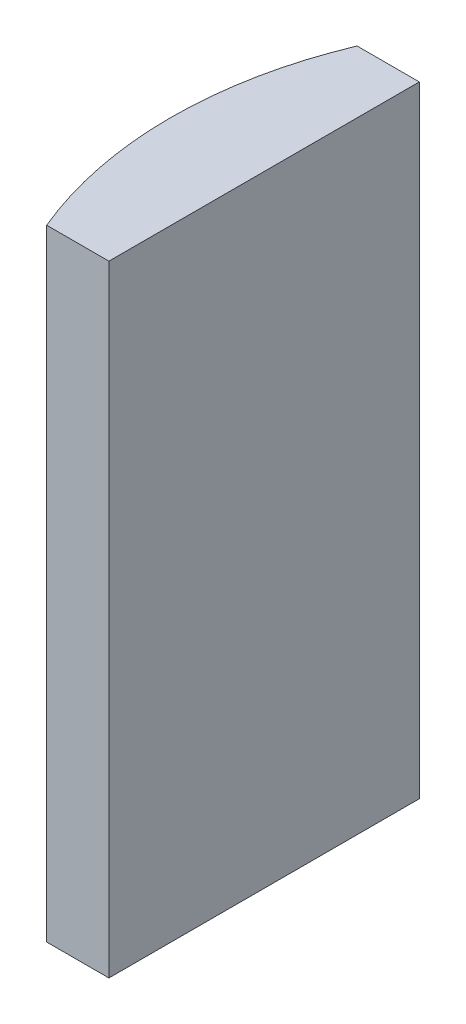
ISO-10303-21;
HEADER;
FILE_DESCRIPTION(('STEP AP214'),'2;1');
FILE_NAME('part.step','',(''),(''),'','','');
FILE_SCHEMA(('AUTOMOTIVE_DESIGN { 1 0 10303 214 1 1 1 1 }'));
ENDSEC;
DATA;
#1=APPLICATION_CONTEXT('core data for automotive mechanical design processes');
#2=APPLICATION_PROTOCOL_DEFINITION('international standard','automotive_design',2000,#1);
#3=PRODUCT_CONTEXT('',#1,'mechanical');
#4=PRODUCT('Part','Part','',(#3));
#5=PRODUCT_RELATED_PRODUCT_CATEGORY('part','',(#4));
#6=PRODUCT_DEFINITION_FORMATION('','',#4);
#7=PRODUCT_DEFINITION_CONTEXT('part definition',#1,'design');
#8=PRODUCT_DEFINITION('design','',#6,#7);
#9=PRODUCT_DEFINITION_SHAPE('','',#8);
#10=(LENGTH_UNIT() NAMED_UNIT(*) SI_UNIT(.MILLI.,.METRE.));
#11=(NAMED_UNIT(*) PLANE_ANGLE_UNIT() SI_UNIT($,.RADIAN.));
#12=(NAMED_UNIT(*) SI_UNIT($,.STERADIAN.) SOLID_ANGLE_UNIT());
#13=UNCERTAINTY_MEASURE_WITH_UNIT(LENGTH_MEASURE(1.E-05),#10,'distance_accuracy_value','');
#14=(GEOMETRIC_REPRESENTATION_CONTEXT(3) GLOBAL_UNCERTAINTY_ASSIGNED_CONTEXT((#13)) GLOBAL_UNIT_ASSIGNED_CONTEXT((#10,
#11,#12)) REPRESENTATION_CONTEXT('',''));
#15=CARTESIAN_POINT('',(0.,0.,0.));
#16=DIRECTION('',(0.,0.,1.));
#17=DIRECTION('',(1.,0.,0.));
#18=AXIS2_PLACEMENT_3D('',#15,#16,#17);
#19=CARTESIAN_POINT('',(4.35520433485127,20.,0.));
#20=DIRECTION('',(0.,-1.,0.));
#21=DIRECTION('',(0.,0.,-1.));
#22=AXIS2_PLACEMENT_3D('',#19,#20,#21);
#23=CYLINDRICAL_SURFACE('',#22,12.93);
#24=CARTESIAN_POINT('',(4.35520433485127,0.,0.));
#25=DIRECTION('',(0.,1.,0.));
#26=DIRECTION('',(0.,0.,1.));
#27=AXIS2_PLACEMENT_3D('',#24,#25,#26);
#28=CIRCLE('',#27,12.93);
#29=CARTESIAN_POINT('',(-7.56892666073915,0.,-5.));
#30=VERTEX_POINT('',#29);
#31=CARTESIAN_POINT('',(-7.56892666073915,0.,5.));
#32=VERTEX_POINT('',#31);
#33=EDGE_CURVE('E100',#30,#32,#28,.T.);
#34=ORIENTED_EDGE('',*,*,#33,.T.);
#35=DIRECTION('',(0.,-1.,0.));
#36=VECTOR('',#35,1.);
#37=CARTESIAN_POINT('',(-7.56892666073915,20.,5.));
#38=LINE('',#37,#36);
#39=CARTESIAN_POINT('',(-7.56892666073915,20.,5.));
#40=VERTEX_POINT('',#39);
#41=EDGE_CURVE('E11',#40,#32,#38,.T.);
#42=ORIENTED_EDGE('',*,*,#41,.F.);
#43=CARTESIAN_POINT('',(4.35520433485127,20.,0.));
#44=DIRECTION('',(0.,1.,0.));
#45=DIRECTION('',(0.,0.,1.));
#46=AXIS2_PLACEMENT_3D('',#43,#44,#45);
#47=CIRCLE('',#46,12.93);
#48=CARTESIAN_POINT('',(-7.56892666073915,20.,-5.));
#49=VERTEX_POINT('',#48);
#50=EDGE_CURVE('E88',#49,#40,#47,.T.);
#51=ORIENTED_EDGE('',*,*,#50,.F.);
#52=DIRECTION('',(0.,-1.,0.));
#53=VECTOR('',#52,1.);
#54=CARTESIAN_POINT('',(-7.56892666073915,20.,-5.));
#55=LINE('',#54,#53);
#56=EDGE_CURVE('E96',#49,#30,#55,.T.);
#57=ORIENTED_EDGE('',*,*,#56,.T.);
#58=EDGE_LOOP('',(#34,#42,#51,#57));
#59=FACE_BOUND('',#58,.T.);
#60=ADVANCED_FACE('F37',(#59),#23,.T.);
#61=CARTESIAN_POINT('',(-7.56892666073915,20.,5.));
#62=DIRECTION('',(0.,0.,-1.));
#63=DIRECTION('',(-1.,0.,0.));
#64=AXIS2_PLACEMENT_3D('',#61,#62,#63);
#65=PLANE('',#64);
#66=DIRECTION('',(1.,0.,0.));
#67=VECTOR('',#66,1.);
#68=CARTESIAN_POINT('',(-7.56892666073915,0.,5.));
#69=LINE('',#68,#67);
#70=CARTESIAN_POINT('',(-5.56479566514873,0.,5.));
#71=VERTEX_POINT('',#70);
#72=EDGE_CURVE('E92',#32,#71,#69,.T.);
#73=ORIENTED_EDGE('',*,*,#72,.T.);
#74=DIRECTION('',(0.,-1.,0.));
#75=VECTOR('',#74,1.);
#76=CARTESIAN_POINT('',(-5.56479566514873,20.,5.));
#77=LINE('',#76,#75);
#78=CARTESIAN_POINT('',(-5.56479566514873,20.,5.));
#79=VERTEX_POINT('',#78);
#80=EDGE_CURVE('E45',#79,#71,#77,.T.);
#81=ORIENTED_EDGE('',*,*,#80,.F.);
#82=DIRECTION('',(1.,0.,0.));
#83=VECTOR('',#82,1.);
#84=CARTESIAN_POINT('',(-7.56892666073915,20.,5.));
#85=LINE('',#84,#83);
#86=EDGE_CURVE('E83',#40,#79,#85,.T.);
#87=ORIENTED_EDGE('',*,*,#86,.F.);
#88=ORIENTED_EDGE('',*,*,#41,.T.);
#89=EDGE_LOOP('',(#73,#81,#87,#88));
#90=FACE_BOUND('',#89,.T.);
#91=ADVANCED_FACE('F91',(#90),#65,.F.);
#92=CARTESIAN_POINT('',(-5.56479566514874,20.,-5.));
#93=DIRECTION('',(-1.,0.,0.));
#94=DIRECTION('',(0.,0.,1.));
#95=AXIS2_PLACEMENT_3D('',#92,#93,#94);
#96=PLANE('',#95);
#97=DIRECTION('',(0.,0.,-1.));
#98=VECTOR('',#97,1.);
#99=CARTESIAN_POINT('',(-5.56479566514874,0.,-5.));
#100=LINE('',#99,#98);
#101=CARTESIAN_POINT('',(-5.56479566514874,0.,-5.));
#102=VERTEX_POINT('',#101);
#103=EDGE_CURVE('E70',#71,#102,#100,.T.);
#104=ORIENTED_EDGE('',*,*,#103,.T.);
#105=DIRECTION('',(0.,-1.,0.));
#106=VECTOR('',#105,1.);
#107=CARTESIAN_POINT('',(-5.56479566514874,20.,-5.));
#108=LINE('',#107,#106);
#109=CARTESIAN_POINT('',(-5.56479566514874,20.,-5.));
#110=VERTEX_POINT('',#109);
#111=EDGE_CURVE('E93',#110,#102,#108,.T.);
#112=ORIENTED_EDGE('',*,*,#111,.F.);
#113=DIRECTION('',(0.,0.,-1.));
#114=VECTOR('',#113,1.);
#115=CARTESIAN_POINT('',(-5.56479566514874,20.,-5.));
#116=LINE('',#115,#114);
#117=EDGE_CURVE('E86',#79,#110,#116,.T.);
#118=ORIENTED_EDGE('',*,*,#117,.F.);
#119=ORIENTED_EDGE('',*,*,#80,.T.);
#120=EDGE_LOOP('',(#104,#112,#118,#119));
#121=FACE_BOUND('',#120,.T.);
#122=ADVANCED_FACE('F94',(#121),#96,.F.);
#123=CARTESIAN_POINT('',(-7.56892666073915,20.,-5.));
#124=DIRECTION('',(0.,0.,1.));
#125=DIRECTION('',(1.,0.,0.));
#126=AXIS2_PLACEMENT_3D('',#123,#124,#125);
#127=PLANE('',#126);
#128=DIRECTION('',(-1.,0.,0.));
#129=VECTOR('',#128,1.);
#130=CARTESIAN_POINT('',(-7.56892666073915,0.,-5.));
#131=LINE('',#130,#129);
#132=EDGE_CURVE('E76',#102,#30,#131,.T.);
#133=ORIENTED_EDGE('',*,*,#132,.T.);
#134=ORIENTED_EDGE('',*,*,#56,.F.);
#135=DIRECTION('',(-1.,0.,0.));
#136=VECTOR('',#135,1.);
#137=CARTESIAN_POINT('',(-7.56892666073915,20.,-5.));
#138=LINE('',#137,#136);
#139=EDGE_CURVE('E53',#110,#49,#138,.T.);
#140=ORIENTED_EDGE('',*,*,#139,.F.);
#141=ORIENTED_EDGE('',*,*,#111,.T.);
#142=EDGE_LOOP('',(#133,#134,#140,#141));
#143=FACE_BOUND('',#142,.T.);
#144=ADVANCED_FACE('F107',(#143),#127,.F.);
#145=CARTESIAN_POINT('',(4.35520433485127,20.,0.));
#146=DIRECTION('',(0.,1.,0.));
#147=DIRECTION('',(0.,0.,1.));
#148=AXIS2_PLACEMENT_3D('',#145,#146,#147);
#149=PLANE('',#148);
#150=ORIENTED_EDGE('',*,*,#50,.T.);
#151=ORIENTED_EDGE('',*,*,#86,.T.);
#152=ORIENTED_EDGE('',*,*,#117,.T.);
#153=ORIENTED_EDGE('',*,*,#139,.T.);
#154=EDGE_LOOP('',(#150,#151,#152,#153));
#155=FACE_BOUND('',#154,.T.);
#156=ADVANCED_FACE('F84',(#155),#149,.T.);
#157=CARTESIAN_POINT('',(4.35520433485127,0.,0.));
#158=DIRECTION('',(0.,1.,0.));
#159=DIRECTION('',(0.,0.,1.));
#160=AXIS2_PLACEMENT_3D('',#157,#158,#159);
#161=PLANE('',#160);
#162=ORIENTED_EDGE('',*,*,#33,.F.);
#163=ORIENTED_EDGE('',*,*,#132,.F.);
#164=ORIENTED_EDGE('',*,*,#103,.F.);
#165=ORIENTED_EDGE('',*,*,#72,.F.);
#166=EDGE_LOOP('',(#162,#163,#164,#165));
#167=FACE_BOUND('',#166,.T.);
#168=ADVANCED_FACE('F110',(#167),#161,.F.);
#169=CLOSED_SHELL('',(#60,#91,#122,#144,#156,#168));
#170=MANIFOLD_SOLID_BREP('B2',#169);
#171=ADVANCED_BREP_SHAPE_REPRESENTATION('',(#18,#170),#14);
#172=SHAPE_DEFINITION_REPRESENTATION(#9,#171);
ENDSEC;
END-ISO-10303-21;
